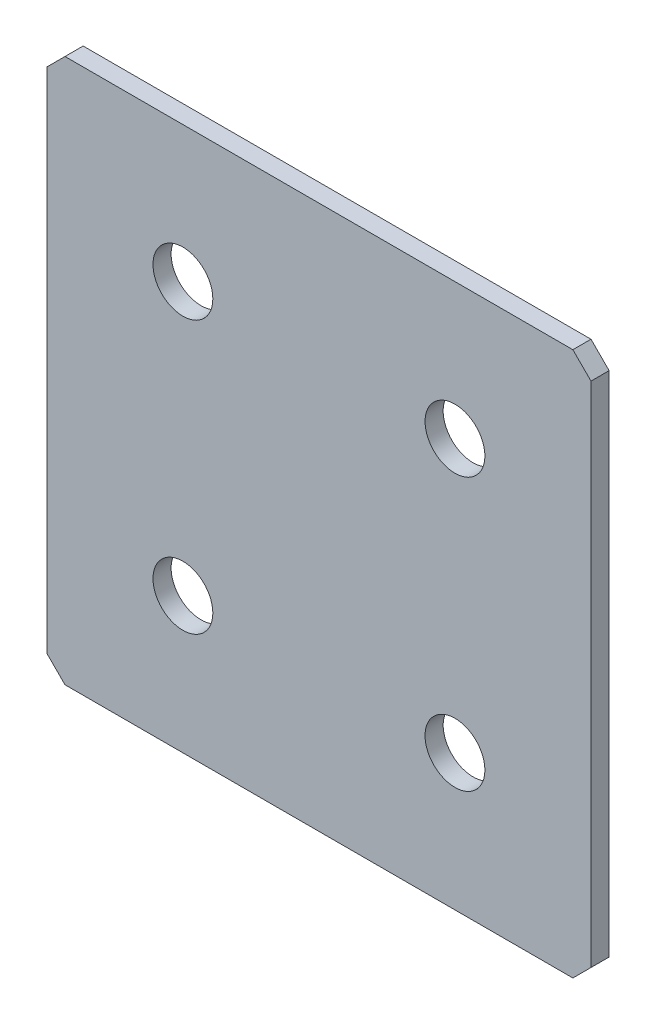
ISO-10303-21;
HEADER;
FILE_DESCRIPTION(('STEP AP214'),'2;1');
FILE_NAME('part.step','',(''),(''),'','','');
FILE_SCHEMA(('AUTOMOTIVE_DESIGN { 1 0 10303 214 1 1 1 1 }'));
ENDSEC;
DATA;
#1=APPLICATION_CONTEXT('core data for automotive mechanical design processes');
#2=APPLICATION_PROTOCOL_DEFINITION('international standard','automotive_design',2000,#1);
#3=PRODUCT_CONTEXT('',#1,'mechanical');
#4=PRODUCT('Part','Part','',(#3));
#5=PRODUCT_RELATED_PRODUCT_CATEGORY('part','',(#4));
#6=PRODUCT_DEFINITION_FORMATION('','',#4);
#7=PRODUCT_DEFINITION_CONTEXT('part definition',#1,'design');
#8=PRODUCT_DEFINITION('design','',#6,#7);
#9=PRODUCT_DEFINITION_SHAPE('','',#8);
#10=(LENGTH_UNIT() NAMED_UNIT(*) SI_UNIT(.MILLI.,.METRE.));
#11=(NAMED_UNIT(*) PLANE_ANGLE_UNIT() SI_UNIT($,.RADIAN.));
#12=(NAMED_UNIT(*) SI_UNIT($,.STERADIAN.) SOLID_ANGLE_UNIT());
#13=UNCERTAINTY_MEASURE_WITH_UNIT(LENGTH_MEASURE(1.E-05),#10,'distance_accuracy_value','');
#14=(GEOMETRIC_REPRESENTATION_CONTEXT(3) GLOBAL_UNCERTAINTY_ASSIGNED_CONTEXT((#13)) GLOBAL_UNIT_ASSIGNED_CONTEXT((#10,
#11,#12)) REPRESENTATION_CONTEXT('',''));
#15=CARTESIAN_POINT('',(0.,0.,0.));
#16=DIRECTION('',(0.,0.,1.));
#17=DIRECTION('',(1.,0.,0.));
#18=AXIS2_PLACEMENT_3D('',#15,#16,#17);
#19=CARTESIAN_POINT('',(30.,-30.,2.));
#20=DIRECTION('',(-1.,0.,0.));
#21=DIRECTION('',(0.,0.,1.));
#22=AXIS2_PLACEMENT_3D('',#19,#20,#21);
#23=PLANE('',#22);
#24=DIRECTION('',(0.,1.,0.));
#25=VECTOR('',#24,1.);
#26=CARTESIAN_POINT('',(30.,-30.,2.));
#27=LINE('',#26,#25);
#28=CARTESIAN_POINT('',(30.,-28.,2.));
#29=VERTEX_POINT('',#28);
#30=CARTESIAN_POINT('',(30.,28.,2.));
#31=VERTEX_POINT('',#30);
#32=EDGE_CURVE('E136',#29,#31,#27,.T.);
#33=ORIENTED_EDGE('',*,*,#32,.F.);
#34=DIRECTION('',(0.,0.,-1.));
#35=VECTOR('',#34,1.);
#36=CARTESIAN_POINT('',(30.,-28.,2.));
#37=LINE('',#36,#35);
#38=CARTESIAN_POINT('',(30.,-28.,0.));
#39=VERTEX_POINT('',#38);
#40=EDGE_CURVE('E176',#29,#39,#37,.T.);
#41=ORIENTED_EDGE('',*,*,#40,.T.);
#42=DIRECTION('',(0.,1.,0.));
#43=VECTOR('',#42,1.);
#44=CARTESIAN_POINT('',(30.,-30.,0.));
#45=LINE('',#44,#43);
#46=CARTESIAN_POINT('',(30.,28.,0.));
#47=VERTEX_POINT('',#46);
#48=EDGE_CURVE('E188',#39,#47,#45,.T.);
#49=ORIENTED_EDGE('',*,*,#48,.T.);
#50=DIRECTION('',(0.,0.,1.));
#51=VECTOR('',#50,1.);
#52=CARTESIAN_POINT('',(30.,28.,2.));
#53=LINE('',#52,#51);
#54=EDGE_CURVE('E173',#47,#31,#53,.T.);
#55=ORIENTED_EDGE('',*,*,#54,.T.);
#56=EDGE_LOOP('',(#33,#41,#49,#55));
#57=FACE_BOUND('',#56,.T.);
#58=ADVANCED_FACE('F41',(#57),#23,.F.);
#59=CARTESIAN_POINT('',(-30.,30.,2.));
#60=DIRECTION('',(0.,-1.,0.));
#61=DIRECTION('',(0.,0.,-1.));
#62=AXIS2_PLACEMENT_3D('',#59,#60,#61);
#63=PLANE('',#62);
#64=DIRECTION('',(-1.,0.,0.));
#65=VECTOR('',#64,1.);
#66=CARTESIAN_POINT('',(-30.,30.,0.));
#67=LINE('',#66,#65);
#68=CARTESIAN_POINT('',(28.,30.,0.));
#69=VERTEX_POINT('',#68);
#70=CARTESIAN_POINT('',(-28.,30.,0.));
#71=VERTEX_POINT('',#70);
#72=EDGE_CURVE('E145',#69,#71,#67,.T.);
#73=ORIENTED_EDGE('',*,*,#72,.T.);
#74=DIRECTION('',(0.,0.,1.));
#75=VECTOR('',#74,1.);
#76=CARTESIAN_POINT('',(-28.,30.,2.));
#77=LINE('',#76,#75);
#78=CARTESIAN_POINT('',(-28.,30.,2.));
#79=VERTEX_POINT('',#78);
#80=EDGE_CURVE('E11',#71,#79,#77,.T.);
#81=ORIENTED_EDGE('',*,*,#80,.T.);
#82=DIRECTION('',(-1.,0.,0.));
#83=VECTOR('',#82,1.);
#84=CARTESIAN_POINT('',(-30.,30.,2.));
#85=LINE('',#84,#83);
#86=CARTESIAN_POINT('',(28.,30.,2.));
#87=VERTEX_POINT('',#86);
#88=EDGE_CURVE('E142',#87,#79,#85,.T.);
#89=ORIENTED_EDGE('',*,*,#88,.F.);
#90=DIRECTION('',(0.,0.,-1.));
#91=VECTOR('',#90,1.);
#92=CARTESIAN_POINT('',(28.,30.,2.));
#93=LINE('',#92,#91);
#94=EDGE_CURVE('E50',#87,#69,#93,.T.);
#95=ORIENTED_EDGE('',*,*,#94,.T.);
#96=EDGE_LOOP('',(#73,#81,#89,#95));
#97=FACE_BOUND('',#96,.T.);
#98=ADVANCED_FACE('F184',(#97),#63,.F.);
#99=CARTESIAN_POINT('',(-30.,-30.,2.));
#100=DIRECTION('',(1.,0.,0.));
#101=DIRECTION('',(0.,0.,-1.));
#102=AXIS2_PLACEMENT_3D('',#99,#100,#101);
#103=PLANE('',#102);
#104=DIRECTION('',(0.,-1.,0.));
#105=VECTOR('',#104,1.);
#106=CARTESIAN_POINT('',(-30.,-30.,0.));
#107=LINE('',#106,#105);
#108=CARTESIAN_POINT('',(-30.,28.,0.));
#109=VERTEX_POINT('',#108);
#110=CARTESIAN_POINT('',(-30.,-28.,0.));
#111=VERTEX_POINT('',#110);
#112=EDGE_CURVE('E137',#109,#111,#107,.T.);
#113=ORIENTED_EDGE('',*,*,#112,.T.);
#114=DIRECTION('',(0.,0.,1.));
#115=VECTOR('',#114,1.);
#116=CARTESIAN_POINT('',(-30.,-28.,2.));
#117=LINE('',#116,#115);
#118=CARTESIAN_POINT('',(-30.,-28.,2.));
#119=VERTEX_POINT('',#118);
#120=EDGE_CURVE('E112',#111,#119,#117,.T.);
#121=ORIENTED_EDGE('',*,*,#120,.T.);
#122=DIRECTION('',(0.,-1.,0.));
#123=VECTOR('',#122,1.);
#124=CARTESIAN_POINT('',(-30.,-30.,2.));
#125=LINE('',#124,#123);
#126=CARTESIAN_POINT('',(-30.,28.,2.));
#127=VERTEX_POINT('',#126);
#128=EDGE_CURVE('E194',#127,#119,#125,.T.);
#129=ORIENTED_EDGE('',*,*,#128,.F.);
#130=DIRECTION('',(0.,0.,-1.));
#131=VECTOR('',#130,1.);
#132=CARTESIAN_POINT('',(-30.,28.,2.));
#133=LINE('',#132,#131);
#134=EDGE_CURVE('E118',#127,#109,#133,.T.);
#135=ORIENTED_EDGE('',*,*,#134,.T.);
#136=EDGE_LOOP('',(#113,#121,#129,#135));
#137=FACE_BOUND('',#136,.T.);
#138=ADVANCED_FACE('F246',(#137),#103,.F.);
#139=CARTESIAN_POINT('',(-30.,-30.,2.));
#140=DIRECTION('',(0.,1.,0.));
#141=DIRECTION('',(0.,0.,1.));
#142=AXIS2_PLACEMENT_3D('',#139,#140,#141);
#143=PLANE('',#142);
#144=DIRECTION('',(1.,0.,0.));
#145=VECTOR('',#144,1.);
#146=CARTESIAN_POINT('',(-30.,-30.,2.));
#147=LINE('',#146,#145);
#148=CARTESIAN_POINT('',(-28.,-30.,2.));
#149=VERTEX_POINT('',#148);
#150=CARTESIAN_POINT('',(28.,-30.,2.));
#151=VERTEX_POINT('',#150);
#152=EDGE_CURVE('E128',#149,#151,#147,.T.);
#153=ORIENTED_EDGE('',*,*,#152,.F.);
#154=DIRECTION('',(0.,0.,-1.));
#155=VECTOR('',#154,1.);
#156=CARTESIAN_POINT('',(-28.,-30.,2.));
#157=LINE('',#156,#155);
#158=CARTESIAN_POINT('',(-28.,-30.,0.));
#159=VERTEX_POINT('',#158);
#160=EDGE_CURVE('E111',#149,#159,#157,.T.);
#161=ORIENTED_EDGE('',*,*,#160,.T.);
#162=DIRECTION('',(1.,0.,0.));
#163=VECTOR('',#162,1.);
#164=CARTESIAN_POINT('',(-30.,-30.,0.));
#165=LINE('',#164,#163);
#166=CARTESIAN_POINT('',(28.,-30.,0.));
#167=VERTEX_POINT('',#166);
#168=EDGE_CURVE('E125',#159,#167,#165,.T.);
#169=ORIENTED_EDGE('',*,*,#168,.T.);
#170=DIRECTION('',(0.,0.,1.));
#171=VECTOR('',#170,1.);
#172=CARTESIAN_POINT('',(28.,-30.,2.));
#173=LINE('',#172,#171);
#174=EDGE_CURVE('E131',#167,#151,#173,.T.);
#175=ORIENTED_EDGE('',*,*,#174,.T.);
#176=EDGE_LOOP('',(#153,#161,#169,#175));
#177=FACE_BOUND('',#176,.T.);
#178=ADVANCED_FACE('F124',(#177),#143,.F.);
#179=CARTESIAN_POINT('',(0.,0.,2.));
#180=DIRECTION('',(0.,0.,-1.));
#181=DIRECTION('',(-1.,0.,0.));
#182=AXIS2_PLACEMENT_3D('',#179,#180,#181);
#183=PLANE('',#182);
#184=CARTESIAN_POINT('',(-15.,15.,2.));
#185=DIRECTION('',(0.,0.,1.));
#186=DIRECTION('',(1.,0.,0.));
#187=AXIS2_PLACEMENT_3D('',#184,#185,#186);
#188=CIRCLE('',#187,3.3);
#189=CARTESIAN_POINT('',(-11.7,15.,2.));
#190=VERTEX_POINT('',#189);
#191=EDGE_CURVE('E226',#190,#190,#188,.T.);
#192=ORIENTED_EDGE('',*,*,#191,.F.);
#193=EDGE_LOOP('',(#192));
#194=FACE_BOUND('',#193,.T.);
#195=CARTESIAN_POINT('',(15.,15.,2.));
#196=DIRECTION('',(0.,0.,1.));
#197=DIRECTION('',(1.,0.,0.));
#198=AXIS2_PLACEMENT_3D('',#195,#196,#197);
#199=CIRCLE('',#198,3.3);
#200=CARTESIAN_POINT('',(18.3,15.,2.));
#201=VERTEX_POINT('',#200);
#202=EDGE_CURVE('E218',#201,#201,#199,.T.);
#203=ORIENTED_EDGE('',*,*,#202,.F.);
#204=EDGE_LOOP('',(#203));
#205=FACE_BOUND('',#204,.T.);
#206=CARTESIAN_POINT('',(-15.,-15.,2.));
#207=DIRECTION('',(0.,0.,1.));
#208=DIRECTION('',(1.,0.,0.));
#209=AXIS2_PLACEMENT_3D('',#206,#207,#208);
#210=CIRCLE('',#209,3.3);
#211=CARTESIAN_POINT('',(-11.7,-15.,2.));
#212=VERTEX_POINT('',#211);
#213=EDGE_CURVE('E210',#212,#212,#210,.T.);
#214=ORIENTED_EDGE('',*,*,#213,.F.);
#215=EDGE_LOOP('',(#214));
#216=FACE_BOUND('',#215,.T.);
#217=CARTESIAN_POINT('',(15.,-15.,2.));
#218=DIRECTION('',(0.,0.,1.));
#219=DIRECTION('',(1.,0.,0.));
#220=AXIS2_PLACEMENT_3D('',#217,#218,#219);
#221=CIRCLE('',#220,3.3);
#222=CARTESIAN_POINT('',(18.3,-15.,2.));
#223=VERTEX_POINT('',#222);
#224=EDGE_CURVE('E202',#223,#223,#221,.T.);
#225=ORIENTED_EDGE('',*,*,#224,.F.);
#226=EDGE_LOOP('',(#225));
#227=FACE_BOUND('',#226,.T.);
#228=ORIENTED_EDGE('',*,*,#128,.T.);
#229=DIRECTION('',(-0.707106781186546,0.707106781186549,0.));
#230=VECTOR('',#229,1.);
#231=CARTESIAN_POINT('',(-28.,-30.,2.));
#232=LINE('',#231,#230);
#233=EDGE_CURVE('E170',#119,#149,#232,.F.);
#234=ORIENTED_EDGE('',*,*,#233,.T.);
#235=ORIENTED_EDGE('',*,*,#152,.T.);
#236=DIRECTION('',(-0.707106781186549,-0.707106781186546,0.));
#237=VECTOR('',#236,1.);
#238=CARTESIAN_POINT('',(30.,-28.,2.));
#239=LINE('',#238,#237);
#240=EDGE_CURVE('E168',#151,#29,#239,.F.);
#241=ORIENTED_EDGE('',*,*,#240,.T.);
#242=ORIENTED_EDGE('',*,*,#32,.T.);
#243=DIRECTION('',(0.707106781186546,-0.707106781186549,0.));
#244=VECTOR('',#243,1.);
#245=CARTESIAN_POINT('',(28.,30.,2.));
#246=LINE('',#245,#244);
#247=EDGE_CURVE('E62',#31,#87,#246,.F.);
#248=ORIENTED_EDGE('',*,*,#247,.T.);
#249=ORIENTED_EDGE('',*,*,#88,.T.);
#250=DIRECTION('',(0.707106781186549,0.707106781186546,0.));
#251=VECTOR('',#250,1.);
#252=CARTESIAN_POINT('',(-30.,28.,2.));
#253=LINE('',#252,#251);
#254=EDGE_CURVE('E165',#79,#127,#253,.F.);
#255=ORIENTED_EDGE('',*,*,#254,.T.);
#256=EDGE_LOOP('',(#228,#234,#235,#241,#242,#248,#249,#255));
#257=FACE_BOUND('',#256,.T.);
#258=ADVANCED_FACE('F233',(#194,#205,#216,#227,#257),#183,.F.);
#259=CARTESIAN_POINT('',(0.,0.,0.));
#260=DIRECTION('',(0.,0.,-1.));
#261=DIRECTION('',(-1.,0.,0.));
#262=AXIS2_PLACEMENT_3D('',#259,#260,#261);
#263=PLANE('',#262);
#264=CARTESIAN_POINT('',(-15.,15.,0.));
#265=DIRECTION('',(0.,0.,1.));
#266=DIRECTION('',(1.,0.,0.));
#267=AXIS2_PLACEMENT_3D('',#264,#265,#266);
#268=CIRCLE('',#267,3.3);
#269=CARTESIAN_POINT('',(-11.7,15.,0.));
#270=VERTEX_POINT('',#269);
#271=EDGE_CURVE('E222',#270,#270,#268,.T.);
#272=ORIENTED_EDGE('',*,*,#271,.T.);
#273=EDGE_LOOP('',(#272));
#274=FACE_BOUND('',#273,.T.);
#275=CARTESIAN_POINT('',(15.,15.,0.));
#276=DIRECTION('',(0.,0.,1.));
#277=DIRECTION('',(1.,0.,0.));
#278=AXIS2_PLACEMENT_3D('',#275,#276,#277);
#279=CIRCLE('',#278,3.3);
#280=CARTESIAN_POINT('',(18.3,15.,0.));
#281=VERTEX_POINT('',#280);
#282=EDGE_CURVE('E214',#281,#281,#279,.T.);
#283=ORIENTED_EDGE('',*,*,#282,.T.);
#284=EDGE_LOOP('',(#283));
#285=FACE_BOUND('',#284,.T.);
#286=CARTESIAN_POINT('',(-15.,-15.,0.));
#287=DIRECTION('',(0.,0.,1.));
#288=DIRECTION('',(1.,0.,0.));
#289=AXIS2_PLACEMENT_3D('',#286,#287,#288);
#290=CIRCLE('',#289,3.3);
#291=CARTESIAN_POINT('',(-11.7,-15.,0.));
#292=VERTEX_POINT('',#291);
#293=EDGE_CURVE('E206',#292,#292,#290,.T.);
#294=ORIENTED_EDGE('',*,*,#293,.T.);
#295=EDGE_LOOP('',(#294));
#296=FACE_BOUND('',#295,.T.);
#297=CARTESIAN_POINT('',(15.,-15.,0.));
#298=DIRECTION('',(0.,0.,1.));
#299=DIRECTION('',(1.,0.,0.));
#300=AXIS2_PLACEMENT_3D('',#297,#298,#299);
#301=CIRCLE('',#300,3.3);
#302=CARTESIAN_POINT('',(18.3,-15.,0.));
#303=VERTEX_POINT('',#302);
#304=EDGE_CURVE('E189',#303,#303,#301,.T.);
#305=ORIENTED_EDGE('',*,*,#304,.T.);
#306=EDGE_LOOP('',(#305));
#307=FACE_BOUND('',#306,.T.);
#308=ORIENTED_EDGE('',*,*,#168,.F.);
#309=DIRECTION('',(0.707106781186546,-0.707106781186549,0.));
#310=VECTOR('',#309,1.);
#311=CARTESIAN_POINT('',(-29.0000000000001,-29.,0.));
#312=LINE('',#311,#310);
#313=EDGE_CURVE('E107',#159,#111,#312,.F.);
#314=ORIENTED_EDGE('',*,*,#313,.T.);
#315=ORIENTED_EDGE('',*,*,#112,.F.);
#316=DIRECTION('',(-0.707106781186549,-0.707106781186546,0.));
#317=VECTOR('',#316,1.);
#318=CARTESIAN_POINT('',(-28.9999999999999,29.,0.));
#319=LINE('',#318,#317);
#320=EDGE_CURVE('E153',#109,#71,#319,.F.);
#321=ORIENTED_EDGE('',*,*,#320,.T.);
#322=ORIENTED_EDGE('',*,*,#72,.F.);
#323=DIRECTION('',(-0.707106781186546,0.707106781186549,0.));
#324=VECTOR('',#323,1.);
#325=CARTESIAN_POINT('',(29.0000000000001,29.,0.));
#326=LINE('',#325,#324);
#327=EDGE_CURVE('E130',#69,#47,#326,.F.);
#328=ORIENTED_EDGE('',*,*,#327,.T.);
#329=ORIENTED_EDGE('',*,*,#48,.F.);
#330=DIRECTION('',(0.707106781186549,0.707106781186546,0.));
#331=VECTOR('',#330,1.);
#332=CARTESIAN_POINT('',(28.9999999999999,-29.,0.));
#333=LINE('',#332,#331);
#334=EDGE_CURVE('E119',#39,#167,#333,.F.);
#335=ORIENTED_EDGE('',*,*,#334,.T.);
#336=EDGE_LOOP('',(#308,#314,#315,#321,#322,#328,#329,#335));
#337=FACE_BOUND('',#336,.T.);
#338=ADVANCED_FACE('F133',(#274,#285,#296,#307,#337),#263,.T.);
#339=CARTESIAN_POINT('',(-28.,-30.,2.));
#340=DIRECTION('',(0.707106781186549,0.707106781186546,0.));
#341=DIRECTION('',(0.,0.,-1.));
#342=AXIS2_PLACEMENT_3D('',#339,#340,#341);
#343=PLANE('',#342);
#344=ORIENTED_EDGE('',*,*,#233,.F.);
#345=ORIENTED_EDGE('',*,*,#120,.F.);
#346=ORIENTED_EDGE('',*,*,#313,.F.);
#347=ORIENTED_EDGE('',*,*,#160,.F.);
#348=EDGE_LOOP('',(#344,#345,#346,#347));
#349=FACE_BOUND('',#348,.T.);
#350=ADVANCED_FACE('F110',(#349),#343,.F.);
#351=CARTESIAN_POINT('',(30.,-28.,2.));
#352=DIRECTION('',(-0.707106781186546,0.707106781186549,0.));
#353=DIRECTION('',(0.,0.,-1.));
#354=AXIS2_PLACEMENT_3D('',#351,#352,#353);
#355=PLANE('',#354);
#356=ORIENTED_EDGE('',*,*,#240,.F.);
#357=ORIENTED_EDGE('',*,*,#174,.F.);
#358=ORIENTED_EDGE('',*,*,#334,.F.);
#359=ORIENTED_EDGE('',*,*,#40,.F.);
#360=EDGE_LOOP('',(#356,#357,#358,#359));
#361=FACE_BOUND('',#360,.T.);
#362=ADVANCED_FACE('F250',(#361),#355,.F.);
#363=CARTESIAN_POINT('',(-30.,28.,2.));
#364=DIRECTION('',(0.707106781186546,-0.707106781186549,0.));
#365=DIRECTION('',(0.,0.,-1.));
#366=AXIS2_PLACEMENT_3D('',#363,#364,#365);
#367=PLANE('',#366);
#368=ORIENTED_EDGE('',*,*,#254,.F.);
#369=ORIENTED_EDGE('',*,*,#80,.F.);
#370=ORIENTED_EDGE('',*,*,#320,.F.);
#371=ORIENTED_EDGE('',*,*,#134,.F.);
#372=EDGE_LOOP('',(#368,#369,#370,#371));
#373=FACE_BOUND('',#372,.T.);
#374=ADVANCED_FACE('F248',(#373),#367,.F.);
#375=CARTESIAN_POINT('',(28.,30.,2.));
#376=DIRECTION('',(-0.707106781186549,-0.707106781186546,0.));
#377=DIRECTION('',(0.,0.,-1.));
#378=AXIS2_PLACEMENT_3D('',#375,#376,#377);
#379=PLANE('',#378);
#380=ORIENTED_EDGE('',*,*,#247,.F.);
#381=ORIENTED_EDGE('',*,*,#54,.F.);
#382=ORIENTED_EDGE('',*,*,#327,.F.);
#383=ORIENTED_EDGE('',*,*,#94,.F.);
#384=EDGE_LOOP('',(#380,#381,#382,#383));
#385=FACE_BOUND('',#384,.T.);
#386=ADVANCED_FACE('F43',(#385),#379,.F.);
#387=CARTESIAN_POINT('',(15.,-15.,2.));
#388=DIRECTION('',(0.,0.,1.));
#389=DIRECTION('',(1.,0.,0.));
#390=AXIS2_PLACEMENT_3D('',#387,#388,#389);
#391=CYLINDRICAL_SURFACE('',#390,3.3);
#392=ORIENTED_EDGE('',*,*,#304,.F.);
#393=EDGE_LOOP('',(#392));
#394=FACE_BOUND('',#393,.T.);
#395=ORIENTED_EDGE('',*,*,#224,.T.);
#396=EDGE_LOOP('',(#395));
#397=FACE_BOUND('',#396,.T.);
#398=ADVANCED_FACE('F255',(#394,#397),#391,.F.);
#399=CARTESIAN_POINT('',(-15.,-15.,2.));
#400=DIRECTION('',(0.,0.,1.));
#401=DIRECTION('',(1.,0.,0.));
#402=AXIS2_PLACEMENT_3D('',#399,#400,#401);
#403=CYLINDRICAL_SURFACE('',#402,3.3);
#404=ORIENTED_EDGE('',*,*,#293,.F.);
#405=EDGE_LOOP('',(#404));
#406=FACE_BOUND('',#405,.T.);
#407=ORIENTED_EDGE('',*,*,#213,.T.);
#408=EDGE_LOOP('',(#407));
#409=FACE_BOUND('',#408,.T.);
#410=ADVANCED_FACE('F317',(#406,#409),#403,.F.);
#411=CARTESIAN_POINT('',(15.,15.,2.));
#412=DIRECTION('',(0.,0.,1.));
#413=DIRECTION('',(1.,0.,0.));
#414=AXIS2_PLACEMENT_3D('',#411,#412,#413);
#415=CYLINDRICAL_SURFACE('',#414,3.3);
#416=ORIENTED_EDGE('',*,*,#282,.F.);
#417=EDGE_LOOP('',(#416));
#418=FACE_BOUND('',#417,.T.);
#419=ORIENTED_EDGE('',*,*,#202,.T.);
#420=EDGE_LOOP('',(#419));
#421=FACE_BOUND('',#420,.T.);
#422=ADVANCED_FACE('F325',(#418,#421),#415,.F.);
#423=CARTESIAN_POINT('',(-15.,15.,2.));
#424=DIRECTION('',(0.,0.,1.));
#425=DIRECTION('',(1.,0.,0.));
#426=AXIS2_PLACEMENT_3D('',#423,#424,#425);
#427=CYLINDRICAL_SURFACE('',#426,3.3);
#428=ORIENTED_EDGE('',*,*,#271,.F.);
#429=EDGE_LOOP('',(#428));
#430=FACE_BOUND('',#429,.T.);
#431=ORIENTED_EDGE('',*,*,#191,.T.);
#432=EDGE_LOOP('',(#431));
#433=FACE_BOUND('',#432,.T.);
#434=ADVANCED_FACE('F231',(#430,#433),#427,.F.);
#435=CLOSED_SHELL('',(#58,#98,#138,#178,#258,#338,#350,#362,#374,#386,#398,#410,#422,#434));
#436=MANIFOLD_SOLID_BREP('B2',#435);
#437=ADVANCED_BREP_SHAPE_REPRESENTATION('',(#18,#436),#14);
#438=SHAPE_DEFINITION_REPRESENTATION(#9,#437);
ENDSEC;
END-ISO-10303-21;
